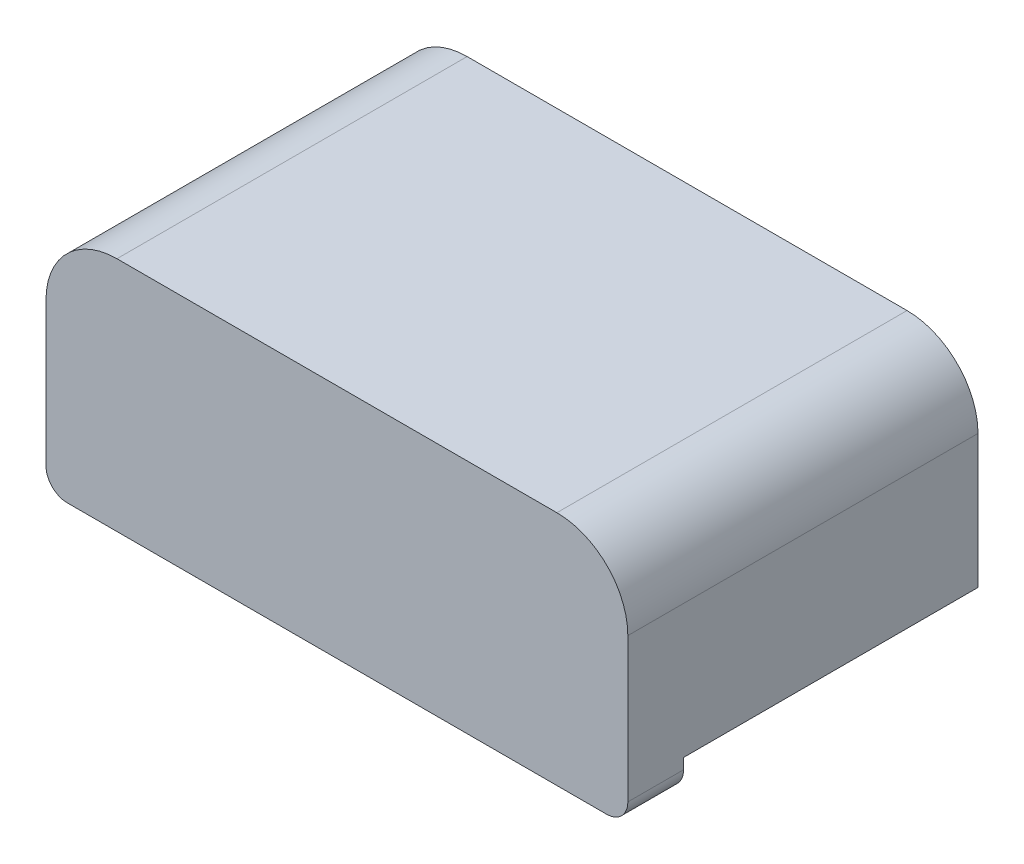
ISO-10303-21;
HEADER;
FILE_DESCRIPTION(('STEP AP214'),'2;1');
FILE_NAME('part.step','',(''),(''),'','','');
FILE_SCHEMA(('AUTOMOTIVE_DESIGN { 1 0 10303 214 1 1 1 1 }'));
ENDSEC;
DATA;
#1=APPLICATION_CONTEXT('core data for automotive mechanical design processes');
#2=APPLICATION_PROTOCOL_DEFINITION('international standard','automotive_design',2000,#1);
#3=PRODUCT_CONTEXT('',#1,'mechanical');
#4=PRODUCT('Part','Part','',(#3));
#5=PRODUCT_RELATED_PRODUCT_CATEGORY('part','',(#4));
#6=PRODUCT_DEFINITION_FORMATION('','',#4);
#7=PRODUCT_DEFINITION_CONTEXT('part definition',#1,'design');
#8=PRODUCT_DEFINITION('design','',#6,#7);
#9=PRODUCT_DEFINITION_SHAPE('','',#8);
#10=(LENGTH_UNIT() NAMED_UNIT(*) SI_UNIT(.MILLI.,.METRE.));
#11=(NAMED_UNIT(*) PLANE_ANGLE_UNIT() SI_UNIT($,.RADIAN.));
#12=(NAMED_UNIT(*) SI_UNIT($,.STERADIAN.) SOLID_ANGLE_UNIT());
#13=UNCERTAINTY_MEASURE_WITH_UNIT(LENGTH_MEASURE(1.E-05),#10,'distance_accuracy_value','');
#14=(GEOMETRIC_REPRESENTATION_CONTEXT(3) GLOBAL_UNCERTAINTY_ASSIGNED_CONTEXT((#13)) GLOBAL_UNIT_ASSIGNED_CONTEXT((#10,
#11,#12)) REPRESENTATION_CONTEXT('',''));
#15=CARTESIAN_POINT('',(0.,0.,0.));
#16=DIRECTION('',(0.,0.,1.));
#17=DIRECTION('',(1.,0.,0.));
#18=AXIS2_PLACEMENT_3D('',#15,#16,#17);
#19=CARTESIAN_POINT('',(0.,0.,0.));
#20=DIRECTION('',(0.,0.,-1.));
#21=DIRECTION('',(-1.,0.,0.));
#22=AXIS2_PLACEMENT_3D('',#19,#20,#21);
#23=PLANE('',#22);
#24=DIRECTION('',(-1.,0.,0.));
#25=VECTOR('',#24,1.);
#26=CARTESIAN_POINT('',(4.1,0.,0.));
#27=LINE('',#26,#25);
#28=CARTESIAN_POINT('',(-3.5,0.,0.));
#29=VERTEX_POINT('',#28);
#30=CARTESIAN_POINT('',(-4.1,0.,0.));
#31=VERTEX_POINT('',#30);
#32=EDGE_CURVE('E39',#29,#31,#27,.T.);
#33=ORIENTED_EDGE('',*,*,#32,.F.);
#34=DIRECTION('',(0.,1.,0.));
#35=VECTOR('',#34,1.);
#36=CARTESIAN_POINT('',(-3.5,-4.05555127546399,0.));
#37=LINE('',#36,#35);
#38=CARTESIAN_POINT('',(-3.5,-0.45,0.));
#39=VERTEX_POINT('',#38);
#40=EDGE_CURVE('E181',#39,#29,#37,.T.);
#41=ORIENTED_EDGE('',*,*,#40,.F.);
#42=DIRECTION('',(1.,0.,0.));
#43=VECTOR('',#42,1.);
#44=CARTESIAN_POINT('',(-4.1,-0.45,0.));
#45=LINE('',#44,#43);
#46=CARTESIAN_POINT('',(-3.8,-0.45,0.));
#47=VERTEX_POINT('',#46);
#48=EDGE_CURVE('E235',#47,#39,#45,.T.);
#49=ORIENTED_EDGE('',*,*,#48,.F.);
#50=CARTESIAN_POINT('',(-3.8,-0.15,0.));
#51=DIRECTION('',(0.,0.,-1.));
#52=DIRECTION('',(-1.,0.,0.));
#53=AXIS2_PLACEMENT_3D('',#50,#51,#52);
#54=CIRCLE('',#53,0.3);
#55=CARTESIAN_POINT('',(-4.1,-0.15,0.));
#56=VERTEX_POINT('',#55);
#57=EDGE_CURVE('E278',#47,#56,#54,.T.);
#58=ORIENTED_EDGE('',*,*,#57,.T.);
#59=DIRECTION('',(0.,-1.,0.));
#60=VECTOR('',#59,1.);
#61=CARTESIAN_POINT('',(-4.1,-0.45,0.));
#62=LINE('',#61,#60);
#63=EDGE_CURVE('E241',#31,#56,#62,.T.);
#64=ORIENTED_EDGE('',*,*,#63,.F.);
#65=EDGE_LOOP('',(#33,#41,#49,#58,#64));
#66=FACE_BOUND('',#65,.T.);
#67=ADVANCED_FACE('F35',(#66),#23,.T.);
#68=CARTESIAN_POINT('',(-1.5,-0.45,0.));
#69=VERTEX_POINT('',#68);
#70=CARTESIAN_POINT('',(1.5,-0.45,0.));
#71=VERTEX_POINT('',#70);
#72=EDGE_CURVE('E179',#69,#71,#45,.T.);
#73=ORIENTED_EDGE('',*,*,#72,.F.);
#74=DIRECTION('',(0.,1.,0.));
#75=VECTOR('',#74,1.);
#76=CARTESIAN_POINT('',(-1.5,-4.05555127546399,0.));
#77=LINE('',#76,#75);
#78=CARTESIAN_POINT('',(-1.5,0.,0.));
#79=VERTEX_POINT('',#78);
#80=EDGE_CURVE('E53',#69,#79,#77,.T.);
#81=ORIENTED_EDGE('',*,*,#80,.T.);
#82=CARTESIAN_POINT('',(1.5,0.,0.));
#83=VERTEX_POINT('',#82);
#84=EDGE_CURVE('E177',#83,#79,#27,.T.);
#85=ORIENTED_EDGE('',*,*,#84,.F.);
#86=DIRECTION('',(0.,1.,0.));
#87=VECTOR('',#86,1.);
#88=CARTESIAN_POINT('',(1.5,-4.05555127546399,0.));
#89=LINE('',#88,#87);
#90=EDGE_CURVE('E376',#71,#83,#89,.T.);
#91=ORIENTED_EDGE('',*,*,#90,.F.);
#92=EDGE_LOOP('',(#73,#81,#85,#91));
#93=FACE_BOUND('',#92,.T.);
#94=ADVANCED_FACE('F175',(#93),#23,.T.);
#95=CARTESIAN_POINT('',(4.1,0.,-17.7760528706251));
#96=DIRECTION('',(0.,1.,0.));
#97=DIRECTION('',(0.,0.,1.));
#98=AXIS2_PLACEMENT_3D('',#95,#96,#97);
#99=PLANE('',#98);
#100=DIRECTION('',(0.,0.,-1.));
#101=VECTOR('',#100,1.);
#102=CARTESIAN_POINT('',(-3.5,0.,-3.));
#103=LINE('',#102,#101);
#104=CARTESIAN_POINT('',(-3.5,0.,-3.));
#105=VERTEX_POINT('',#104);
#106=EDGE_CURVE('E170',#29,#105,#103,.T.);
#107=ORIENTED_EDGE('',*,*,#106,.F.);
#108=ORIENTED_EDGE('',*,*,#32,.T.);
#109=DIRECTION('',(0.,0.,1.));
#110=VECTOR('',#109,1.);
#111=CARTESIAN_POINT('',(-4.1,0.,-17.7760528706251));
#112=LINE('',#111,#110);
#113=CARTESIAN_POINT('',(-4.1,0.,-4.15));
#114=VERTEX_POINT('',#113);
#115=EDGE_CURVE('E188',#114,#31,#112,.T.);
#116=ORIENTED_EDGE('',*,*,#115,.F.);
#117=DIRECTION('',(-1.,0.,0.));
#118=VECTOR('',#117,1.);
#119=CARTESIAN_POINT('',(4.1,0.,-4.15));
#120=LINE('',#119,#118);
#121=CARTESIAN_POINT('',(4.1,0.,-4.15));
#122=VERTEX_POINT('',#121);
#123=EDGE_CURVE('E258',#122,#114,#120,.T.);
#124=ORIENTED_EDGE('',*,*,#123,.F.);
#125=DIRECTION('',(0.,0.,1.));
#126=VECTOR('',#125,1.);
#127=CARTESIAN_POINT('',(4.1,0.,-17.7760528706251));
#128=LINE('',#127,#126);
#129=CARTESIAN_POINT('',(4.1,0.,0.));
#130=VERTEX_POINT('',#129);
#131=EDGE_CURVE('E190',#122,#130,#128,.T.);
#132=ORIENTED_EDGE('',*,*,#131,.T.);
#133=CARTESIAN_POINT('',(3.5,0.,0.));
#134=VERTEX_POINT('',#133);
#135=EDGE_CURVE('E187',#130,#134,#27,.T.);
#136=ORIENTED_EDGE('',*,*,#135,.T.);
#137=DIRECTION('',(0.,0.,1.));
#138=VECTOR('',#137,1.);
#139=CARTESIAN_POINT('',(3.5,0.,-3.));
#140=LINE('',#139,#138);
#141=CARTESIAN_POINT('',(3.5,0.,-3.));
#142=VERTEX_POINT('',#141);
#143=EDGE_CURVE('E375',#142,#134,#140,.T.);
#144=ORIENTED_EDGE('',*,*,#143,.F.);
#145=DIRECTION('',(1.,0.,0.));
#146=VECTOR('',#145,1.);
#147=CARTESIAN_POINT('',(1.5,0.,-3.));
#148=LINE('',#147,#146);
#149=CARTESIAN_POINT('',(1.5,0.,-3.));
#150=VERTEX_POINT('',#149);
#151=EDGE_CURVE('E384',#150,#142,#148,.T.);
#152=ORIENTED_EDGE('',*,*,#151,.F.);
#153=DIRECTION('',(0.,0.,-1.));
#154=VECTOR('',#153,1.);
#155=CARTESIAN_POINT('',(1.5,0.,-3.));
#156=LINE('',#155,#154);
#157=EDGE_CURVE('E186',#83,#150,#156,.T.);
#158=ORIENTED_EDGE('',*,*,#157,.F.);
#159=ORIENTED_EDGE('',*,*,#84,.T.);
#160=DIRECTION('',(0.,0.,1.));
#161=VECTOR('',#160,1.);
#162=CARTESIAN_POINT('',(-1.5,0.,-3.));
#163=LINE('',#162,#161);
#164=CARTESIAN_POINT('',(-1.5,0.,-3.));
#165=VERTEX_POINT('',#164);
#166=EDGE_CURVE('E162',#165,#79,#163,.T.);
#167=ORIENTED_EDGE('',*,*,#166,.F.);
#168=DIRECTION('',(1.,0.,0.));
#169=VECTOR('',#168,1.);
#170=CARTESIAN_POINT('',(-3.5,0.,-3.));
#171=LINE('',#170,#169);
#172=EDGE_CURVE('E398',#105,#165,#171,.T.);
#173=ORIENTED_EDGE('',*,*,#172,.F.);
#174=EDGE_LOOP('',(#107,#108,#116,#124,#132,#136,#144,#152,#158,#159,#167,#173));
#175=FACE_BOUND('',#174,.T.);
#176=ADVANCED_FACE('F184',(#175),#99,.F.);
#177=CARTESIAN_POINT('',(3.5,-0.45,0.));
#178=VERTEX_POINT('',#177);
#179=CARTESIAN_POINT('',(3.8,-0.45,0.));
#180=VERTEX_POINT('',#179);
#181=EDGE_CURVE('E61',#178,#180,#45,.T.);
#182=ORIENTED_EDGE('',*,*,#181,.F.);
#183=DIRECTION('',(0.,1.,0.));
#184=VECTOR('',#183,1.);
#185=CARTESIAN_POINT('',(3.5,-4.05555127546399,0.));
#186=LINE('',#185,#184);
#187=EDGE_CURVE('E306',#178,#134,#186,.T.);
#188=ORIENTED_EDGE('',*,*,#187,.T.);
#189=ORIENTED_EDGE('',*,*,#135,.F.);
#190=DIRECTION('',(0.,1.,0.));
#191=VECTOR('',#190,1.);
#192=CARTESIAN_POINT('',(4.1,-0.45,0.));
#193=LINE('',#192,#191);
#194=CARTESIAN_POINT('',(4.1,-0.15,0.));
#195=VERTEX_POINT('',#194);
#196=EDGE_CURVE('E231',#195,#130,#193,.T.);
#197=ORIENTED_EDGE('',*,*,#196,.F.);
#198=CARTESIAN_POINT('',(3.8,-0.15,0.));
#199=DIRECTION('',(0.,0.,-1.));
#200=DIRECTION('',(-1.,0.,0.));
#201=AXIS2_PLACEMENT_3D('',#198,#199,#200);
#202=CIRCLE('',#201,0.3);
#203=EDGE_CURVE('E293',#195,#180,#202,.T.);
#204=ORIENTED_EDGE('',*,*,#203,.T.);
#205=EDGE_LOOP('',(#182,#188,#189,#197,#204));
#206=FACE_BOUND('',#205,.T.);
#207=ADVANCED_FACE('F303',(#206),#23,.T.);
#208=CARTESIAN_POINT('',(-4.1,-0.45,0.785));
#209=DIRECTION('',(1.,0.,0.));
#210=DIRECTION('',(0.,0.,-1.));
#211=AXIS2_PLACEMENT_3D('',#208,#209,#210);
#212=PLANE('',#211);
#213=ORIENTED_EDGE('',*,*,#63,.T.);
#214=DIRECTION('',(0.,0.,-1.));
#215=VECTOR('',#214,1.);
#216=CARTESIAN_POINT('',(-4.1,-0.15,0.785));
#217=LINE('',#216,#215);
#218=CARTESIAN_POINT('',(-4.1,-0.15,0.785));
#219=VERTEX_POINT('',#218);
#220=EDGE_CURVE('E12',#56,#219,#217,.F.);
#221=ORIENTED_EDGE('',*,*,#220,.T.);
#222=DIRECTION('',(0.,-1.,0.));
#223=VECTOR('',#222,1.);
#224=CARTESIAN_POINT('',(-4.1,-0.45,0.785));
#225=LINE('',#224,#223);
#226=CARTESIAN_POINT('',(-4.1,1.88,0.785));
#227=VERTEX_POINT('',#226);
#228=EDGE_CURVE('E234',#227,#219,#225,.T.);
#229=ORIENTED_EDGE('',*,*,#228,.F.);
#230=DIRECTION('',(0.,0.,-1.));
#231=VECTOR('',#230,1.);
#232=CARTESIAN_POINT('',(-4.1,1.88,0.785));
#233=LINE('',#232,#231);
#234=CARTESIAN_POINT('',(-4.1,1.88,-4.15));
#235=VERTEX_POINT('',#234);
#236=EDGE_CURVE('E227',#227,#235,#233,.T.);
#237=ORIENTED_EDGE('',*,*,#236,.T.);
#238=DIRECTION('',(0.,1.,0.));
#239=VECTOR('',#238,1.);
#240=CARTESIAN_POINT('',(-4.1,2.88,-4.15));
#241=LINE('',#240,#239);
#242=EDGE_CURVE('E197',#114,#235,#241,.T.);
#243=ORIENTED_EDGE('',*,*,#242,.F.);
#244=ORIENTED_EDGE('',*,*,#115,.T.);
#245=EDGE_LOOP('',(#213,#221,#229,#237,#243,#244));
#246=FACE_BOUND('',#245,.T.);
#247=ADVANCED_FACE('F268',(#246),#212,.F.);
#248=CARTESIAN_POINT('',(-4.1,-0.45,0.785));
#249=DIRECTION('',(0.,1.,0.));
#250=DIRECTION('',(-1.,0.,0.));
#251=AXIS2_PLACEMENT_3D('',#248,#249,#250);
#252=PLANE('',#251);
#253=ORIENTED_EDGE('',*,*,#48,.T.);
#254=DIRECTION('',(0.,0.,1.));
#255=VECTOR('',#254,1.);
#256=CARTESIAN_POINT('',(-3.5,-0.45,-3.));
#257=LINE('',#256,#255);
#258=CARTESIAN_POINT('',(-3.5,-0.45,-3.));
#259=VERTEX_POINT('',#258);
#260=EDGE_CURVE('E366',#259,#39,#257,.T.);
#261=ORIENTED_EDGE('',*,*,#260,.F.);
#262=DIRECTION('',(-1.,0.,0.));
#263=VECTOR('',#262,1.);
#264=CARTESIAN_POINT('',(-3.5,-0.45,-3.));
#265=LINE('',#264,#263);
#266=CARTESIAN_POINT('',(-1.5,-0.45,-3.));
#267=VERTEX_POINT('',#266);
#268=EDGE_CURVE('E180',#267,#259,#265,.T.);
#269=ORIENTED_EDGE('',*,*,#268,.F.);
#270=DIRECTION('',(0.,0.,-1.));
#271=VECTOR('',#270,1.);
#272=CARTESIAN_POINT('',(-1.5,-0.45,-3.));
#273=LINE('',#272,#271);
#274=EDGE_CURVE('E388',#69,#267,#273,.T.);
#275=ORIENTED_EDGE('',*,*,#274,.F.);
#276=ORIENTED_EDGE('',*,*,#72,.T.);
#277=DIRECTION('',(0.,0.,1.));
#278=VECTOR('',#277,1.);
#279=CARTESIAN_POINT('',(1.5,-0.45,-3.));
#280=LINE('',#279,#278);
#281=CARTESIAN_POINT('',(1.5,-0.45,-3.));
#282=VERTEX_POINT('',#281);
#283=EDGE_CURVE('E373',#282,#71,#280,.T.);
#284=ORIENTED_EDGE('',*,*,#283,.F.);
#285=DIRECTION('',(-1.,0.,0.));
#286=VECTOR('',#285,1.);
#287=CARTESIAN_POINT('',(1.5,-0.45,-3.));
#288=LINE('',#287,#286);
#289=CARTESIAN_POINT('',(3.5,-0.45,-3.));
#290=VERTEX_POINT('',#289);
#291=EDGE_CURVE('E195',#290,#282,#288,.T.);
#292=ORIENTED_EDGE('',*,*,#291,.F.);
#293=DIRECTION('',(0.,0.,-1.));
#294=VECTOR('',#293,1.);
#295=CARTESIAN_POINT('',(3.5,-0.45,-3.));
#296=LINE('',#295,#294);
#297=EDGE_CURVE('E207',#178,#290,#296,.T.);
#298=ORIENTED_EDGE('',*,*,#297,.F.);
#299=ORIENTED_EDGE('',*,*,#181,.T.);
#300=DIRECTION('',(0.,0.,-1.));
#301=VECTOR('',#300,1.);
#302=CARTESIAN_POINT('',(3.8,-0.45,0.785));
#303=LINE('',#302,#301);
#304=CARTESIAN_POINT('',(3.8,-0.45,0.785));
#305=VERTEX_POINT('',#304);
#306=EDGE_CURVE('E288',#180,#305,#303,.F.);
#307=ORIENTED_EDGE('',*,*,#306,.T.);
#308=DIRECTION('',(1.,0.,0.));
#309=VECTOR('',#308,1.);
#310=CARTESIAN_POINT('',(-4.1,-0.45,0.785));
#311=LINE('',#310,#309);
#312=CARTESIAN_POINT('',(-3.8,-0.45,0.785));
#313=VERTEX_POINT('',#312);
#314=EDGE_CURVE('E249',#313,#305,#311,.T.);
#315=ORIENTED_EDGE('',*,*,#314,.F.);
#316=DIRECTION('',(0.,0.,-1.));
#317=VECTOR('',#316,1.);
#318=CARTESIAN_POINT('',(-3.8,-0.45,0.785));
#319=LINE('',#318,#317);
#320=EDGE_CURVE('E285',#313,#47,#319,.T.);
#321=ORIENTED_EDGE('',*,*,#320,.T.);
#322=EDGE_LOOP('',(#253,#261,#269,#275,#276,#284,#292,#298,#299,#307,#315,#321));
#323=FACE_BOUND('',#322,.T.);
#324=ADVANCED_FACE('F342',(#323),#252,.F.);
#325=CARTESIAN_POINT('',(4.1,-0.45,0.785));
#326=DIRECTION('',(-1.,0.,0.));
#327=DIRECTION('',(0.,0.,1.));
#328=AXIS2_PLACEMENT_3D('',#325,#326,#327);
#329=PLANE('',#328);
#330=DIRECTION('',(0.,1.,0.));
#331=VECTOR('',#330,1.);
#332=CARTESIAN_POINT('',(4.1,-0.45,0.785));
#333=LINE('',#332,#331);
#334=CARTESIAN_POINT('',(4.1,-0.15,0.785));
#335=VERTEX_POINT('',#334);
#336=CARTESIAN_POINT('',(4.1,1.88,0.785));
#337=VERTEX_POINT('',#336);
#338=EDGE_CURVE('E247',#335,#337,#333,.T.);
#339=ORIENTED_EDGE('',*,*,#338,.F.);
#340=DIRECTION('',(0.,0.,-1.));
#341=VECTOR('',#340,1.);
#342=CARTESIAN_POINT('',(4.1,-0.15,0.785));
#343=LINE('',#342,#341);
#344=EDGE_CURVE('E230',#335,#195,#343,.T.);
#345=ORIENTED_EDGE('',*,*,#344,.T.);
#346=ORIENTED_EDGE('',*,*,#196,.T.);
#347=ORIENTED_EDGE('',*,*,#131,.F.);
#348=DIRECTION('',(0.,-1.,0.));
#349=VECTOR('',#348,1.);
#350=CARTESIAN_POINT('',(4.1,2.88,-4.15));
#351=LINE('',#350,#349);
#352=CARTESIAN_POINT('',(4.1,1.88,-4.15));
#353=VERTEX_POINT('',#352);
#354=EDGE_CURVE('E257',#353,#122,#351,.T.);
#355=ORIENTED_EDGE('',*,*,#354,.F.);
#356=DIRECTION('',(0.,0.,-1.));
#357=VECTOR('',#356,1.);
#358=CARTESIAN_POINT('',(4.1,1.88,0.785));
#359=LINE('',#358,#357);
#360=EDGE_CURVE('E220',#353,#337,#359,.F.);
#361=ORIENTED_EDGE('',*,*,#360,.T.);
#362=EDGE_LOOP('',(#339,#345,#346,#347,#355,#361));
#363=FACE_BOUND('',#362,.T.);
#364=ADVANCED_FACE('F299',(#363),#329,.F.);
#365=CARTESIAN_POINT('',(-4.1,2.88,0.785));
#366=DIRECTION('',(0.,-1.,0.));
#367=DIRECTION('',(0.,0.,-1.));
#368=AXIS2_PLACEMENT_3D('',#365,#366,#367);
#369=PLANE('',#368);
#370=DIRECTION('',(-1.,0.,0.));
#371=VECTOR('',#370,1.);
#372=CARTESIAN_POINT('',(-4.1,2.88,0.785));
#373=LINE('',#372,#371);
#374=CARTESIAN_POINT('',(3.1,2.88,0.785));
#375=VERTEX_POINT('',#374);
#376=CARTESIAN_POINT('',(-3.1,2.88,0.785));
#377=VERTEX_POINT('',#376);
#378=EDGE_CURVE('E213',#375,#377,#373,.T.);
#379=ORIENTED_EDGE('',*,*,#378,.F.);
#380=DIRECTION('',(0.,0.,-1.));
#381=VECTOR('',#380,1.);
#382=CARTESIAN_POINT('',(3.1,2.88,0.785));
#383=LINE('',#382,#381);
#384=CARTESIAN_POINT('',(3.1,2.88,-4.15));
#385=VERTEX_POINT('',#384);
#386=EDGE_CURVE('E212',#375,#385,#383,.T.);
#387=ORIENTED_EDGE('',*,*,#386,.T.);
#388=DIRECTION('',(1.,0.,0.));
#389=VECTOR('',#388,1.);
#390=CARTESIAN_POINT('',(4.1,2.88,-4.15));
#391=LINE('',#390,#389);
#392=CARTESIAN_POINT('',(-3.1,2.88,-4.15));
#393=VERTEX_POINT('',#392);
#394=EDGE_CURVE('E254',#393,#385,#391,.T.);
#395=ORIENTED_EDGE('',*,*,#394,.F.);
#396=DIRECTION('',(0.,0.,-1.));
#397=VECTOR('',#396,1.);
#398=CARTESIAN_POINT('',(-3.1,2.88,0.785));
#399=LINE('',#398,#397);
#400=EDGE_CURVE('E210',#393,#377,#399,.F.);
#401=ORIENTED_EDGE('',*,*,#400,.T.);
#402=EDGE_LOOP('',(#379,#387,#395,#401));
#403=FACE_BOUND('',#402,.T.);
#404=ADVANCED_FACE('F318',(#403),#369,.F.);
#405=CARTESIAN_POINT('',(0.,0.,0.785));
#406=DIRECTION('',(0.,0.,-1.));
#407=DIRECTION('',(-1.,0.,0.));
#408=AXIS2_PLACEMENT_3D('',#405,#406,#407);
#409=PLANE('',#408);
#410=ORIENTED_EDGE('',*,*,#314,.T.);
#411=CARTESIAN_POINT('',(3.8,-0.15,0.785));
#412=DIRECTION('',(0.,0.,-1.));
#413=DIRECTION('',(-1.,0.,0.));
#414=AXIS2_PLACEMENT_3D('',#411,#412,#413);
#415=CIRCLE('',#414,0.3);
#416=EDGE_CURVE('E45',#305,#335,#415,.F.);
#417=ORIENTED_EDGE('',*,*,#416,.T.);
#418=ORIENTED_EDGE('',*,*,#338,.T.);
#419=CARTESIAN_POINT('',(3.1,1.88,0.785));
#420=DIRECTION('',(0.,0.,-1.));
#421=DIRECTION('',(-1.,0.,0.));
#422=AXIS2_PLACEMENT_3D('',#419,#420,#421);
#423=CIRCLE('',#422,1.);
#424=EDGE_CURVE('E225',#337,#375,#423,.F.);
#425=ORIENTED_EDGE('',*,*,#424,.T.);
#426=ORIENTED_EDGE('',*,*,#378,.T.);
#427=CARTESIAN_POINT('',(-3.1,1.88,0.785));
#428=DIRECTION('',(0.,0.,-1.));
#429=DIRECTION('',(-1.,0.,0.));
#430=AXIS2_PLACEMENT_3D('',#427,#428,#429);
#431=CIRCLE('',#430,1.);
#432=EDGE_CURVE('E223',#377,#227,#431,.F.);
#433=ORIENTED_EDGE('',*,*,#432,.T.);
#434=ORIENTED_EDGE('',*,*,#228,.T.);
#435=CARTESIAN_POINT('',(-3.8,-0.15,0.785));
#436=DIRECTION('',(0.,0.,-1.));
#437=DIRECTION('',(-1.,0.,0.));
#438=AXIS2_PLACEMENT_3D('',#435,#436,#437);
#439=CIRCLE('',#438,0.3);
#440=EDGE_CURVE('E284',#219,#313,#439,.F.);
#441=ORIENTED_EDGE('',*,*,#440,.T.);
#442=EDGE_LOOP('',(#410,#417,#418,#425,#426,#433,#434,#441));
#443=FACE_BOUND('',#442,.T.);
#444=ADVANCED_FACE('F315',(#443),#409,.F.);
#445=CARTESIAN_POINT('',(0.,0.,-4.15));
#446=DIRECTION('',(0.,0.,-1.));
#447=DIRECTION('',(-1.,0.,0.));
#448=AXIS2_PLACEMENT_3D('',#445,#446,#447);
#449=PLANE('',#448);
#450=ORIENTED_EDGE('',*,*,#394,.T.);
#451=CARTESIAN_POINT('',(3.1,1.88,-4.15));
#452=DIRECTION('',(0.,0.,-1.));
#453=DIRECTION('',(-1.,0.,0.));
#454=AXIS2_PLACEMENT_3D('',#451,#452,#453);
#455=CIRCLE('',#454,1.);
#456=EDGE_CURVE('E218',#385,#353,#455,.T.);
#457=ORIENTED_EDGE('',*,*,#456,.T.);
#458=ORIENTED_EDGE('',*,*,#354,.T.);
#459=ORIENTED_EDGE('',*,*,#123,.T.);
#460=ORIENTED_EDGE('',*,*,#242,.T.);
#461=CARTESIAN_POINT('',(-3.1,1.88,-4.15));
#462=DIRECTION('',(0.,0.,-1.));
#463=DIRECTION('',(-1.,0.,0.));
#464=AXIS2_PLACEMENT_3D('',#461,#462,#463);
#465=CIRCLE('',#464,1.);
#466=EDGE_CURVE('E216',#235,#393,#465,.T.);
#467=ORIENTED_EDGE('',*,*,#466,.T.);
#468=EDGE_LOOP('',(#450,#457,#458,#459,#460,#467));
#469=FACE_BOUND('',#468,.T.);
#470=ADVANCED_FACE('F263',(#469),#449,.T.);
#471=CARTESIAN_POINT('',(3.1,1.88,0.785));
#472=DIRECTION('',(0.,0.,-1.));
#473=DIRECTION('',(-1.,0.,0.));
#474=AXIS2_PLACEMENT_3D('',#471,#472,#473);
#475=CYLINDRICAL_SURFACE('',#474,1.);
#476=ORIENTED_EDGE('',*,*,#424,.F.);
#477=ORIENTED_EDGE('',*,*,#360,.F.);
#478=ORIENTED_EDGE('',*,*,#456,.F.);
#479=ORIENTED_EDGE('',*,*,#386,.F.);
#480=EDGE_LOOP('',(#476,#477,#478,#479));
#481=FACE_BOUND('',#480,.T.);
#482=ADVANCED_FACE('F312',(#481),#475,.T.);
#483=CARTESIAN_POINT('',(-3.1,1.88,0.785));
#484=DIRECTION('',(0.,0.,-1.));
#485=DIRECTION('',(-1.,0.,0.));
#486=AXIS2_PLACEMENT_3D('',#483,#484,#485);
#487=CYLINDRICAL_SURFACE('',#486,1.);
#488=ORIENTED_EDGE('',*,*,#432,.F.);
#489=ORIENTED_EDGE('',*,*,#400,.F.);
#490=ORIENTED_EDGE('',*,*,#466,.F.);
#491=ORIENTED_EDGE('',*,*,#236,.F.);
#492=EDGE_LOOP('',(#488,#489,#490,#491));
#493=FACE_BOUND('',#492,.T.);
#494=ADVANCED_FACE('F321',(#493),#487,.T.);
#495=CARTESIAN_POINT('',(3.8,-0.15,0.785));
#496=DIRECTION('',(0.,0.,-1.));
#497=DIRECTION('',(-1.,0.,0.));
#498=AXIS2_PLACEMENT_3D('',#495,#496,#497);
#499=CYLINDRICAL_SURFACE('',#498,0.3);
#500=ORIENTED_EDGE('',*,*,#416,.F.);
#501=ORIENTED_EDGE('',*,*,#306,.F.);
#502=ORIENTED_EDGE('',*,*,#203,.F.);
#503=ORIENTED_EDGE('',*,*,#344,.F.);
#504=EDGE_LOOP('',(#500,#501,#502,#503));
#505=FACE_BOUND('',#504,.T.);
#506=ADVANCED_FACE('F323',(#505),#499,.T.);
#507=CARTESIAN_POINT('',(-3.8,-0.15,0.785));
#508=DIRECTION('',(0.,0.,-1.));
#509=DIRECTION('',(-1.,0.,0.));
#510=AXIS2_PLACEMENT_3D('',#507,#508,#509);
#511=CYLINDRICAL_SURFACE('',#510,0.3);
#512=ORIENTED_EDGE('',*,*,#440,.F.);
#513=ORIENTED_EDGE('',*,*,#220,.F.);
#514=ORIENTED_EDGE('',*,*,#57,.F.);
#515=ORIENTED_EDGE('',*,*,#320,.F.);
#516=EDGE_LOOP('',(#512,#513,#514,#515));
#517=FACE_BOUND('',#516,.T.);
#518=ADVANCED_FACE('F37',(#517),#511,.T.);
#519=CARTESIAN_POINT('',(1.5,-4.05555127546399,-3.));
#520=DIRECTION('',(0.,0.,1.));
#521=DIRECTION('',(1.,0.,0.));
#522=AXIS2_PLACEMENT_3D('',#519,#520,#521);
#523=PLANE('',#522);
#524=DIRECTION('',(0.,1.,0.));
#525=VECTOR('',#524,1.);
#526=CARTESIAN_POINT('',(3.5,-4.05555127546399,-3.));
#527=LINE('',#526,#525);
#528=EDGE_CURVE('E382',#290,#142,#527,.T.);
#529=ORIENTED_EDGE('',*,*,#528,.F.);
#530=ORIENTED_EDGE('',*,*,#291,.T.);
#531=DIRECTION('',(0.,1.,0.));
#532=VECTOR('',#531,1.);
#533=CARTESIAN_POINT('',(1.5,-4.05555127546399,-3.));
#534=LINE('',#533,#532);
#535=EDGE_CURVE('E377',#282,#150,#534,.T.);
#536=ORIENTED_EDGE('',*,*,#535,.T.);
#537=ORIENTED_EDGE('',*,*,#151,.T.);
#538=EDGE_LOOP('',(#529,#530,#536,#537));
#539=FACE_BOUND('',#538,.T.);
#540=ADVANCED_FACE('F410',(#539),#523,.F.);
#541=CARTESIAN_POINT('',(1.5,-4.05555127546399,-3.));
#542=DIRECTION('',(1.,0.,0.));
#543=DIRECTION('',(0.,0.,-1.));
#544=AXIS2_PLACEMENT_3D('',#541,#542,#543);
#545=PLANE('',#544);
#546=ORIENTED_EDGE('',*,*,#535,.F.);
#547=ORIENTED_EDGE('',*,*,#283,.T.);
#548=ORIENTED_EDGE('',*,*,#90,.T.);
#549=ORIENTED_EDGE('',*,*,#157,.T.);
#550=EDGE_LOOP('',(#546,#547,#548,#549));
#551=FACE_BOUND('',#550,.T.);
#552=ADVANCED_FACE('F408',(#551),#545,.F.);
#553=CARTESIAN_POINT('',(3.5,-4.05555127546399,-3.));
#554=DIRECTION('',(-1.,0.,0.));
#555=DIRECTION('',(0.,0.,1.));
#556=AXIS2_PLACEMENT_3D('',#553,#554,#555);
#557=PLANE('',#556);
#558=ORIENTED_EDGE('',*,*,#187,.F.);
#559=ORIENTED_EDGE('',*,*,#297,.T.);
#560=ORIENTED_EDGE('',*,*,#528,.T.);
#561=ORIENTED_EDGE('',*,*,#143,.T.);
#562=EDGE_LOOP('',(#558,#559,#560,#561));
#563=FACE_BOUND('',#562,.T.);
#564=ADVANCED_FACE('F349',(#563),#557,.F.);
#565=CARTESIAN_POINT('',(-3.5,-4.05555127546399,-3.));
#566=DIRECTION('',(0.,0.,1.));
#567=DIRECTION('',(1.,0.,0.));
#568=AXIS2_PLACEMENT_3D('',#565,#566,#567);
#569=PLANE('',#568);
#570=DIRECTION('',(0.,1.,0.));
#571=VECTOR('',#570,1.);
#572=CARTESIAN_POINT('',(-1.5,-4.05555127546399,-3.));
#573=LINE('',#572,#571);
#574=EDGE_CURVE('E165',#267,#165,#573,.T.);
#575=ORIENTED_EDGE('',*,*,#574,.F.);
#576=ORIENTED_EDGE('',*,*,#268,.T.);
#577=DIRECTION('',(0.,1.,0.));
#578=VECTOR('',#577,1.);
#579=CARTESIAN_POINT('',(-3.5,-4.05555127546399,-3.));
#580=LINE('',#579,#578);
#581=EDGE_CURVE('E395',#259,#105,#580,.T.);
#582=ORIENTED_EDGE('',*,*,#581,.T.);
#583=ORIENTED_EDGE('',*,*,#172,.T.);
#584=EDGE_LOOP('',(#575,#576,#582,#583));
#585=FACE_BOUND('',#584,.T.);
#586=ADVANCED_FACE('F405',(#585),#569,.F.);
#587=CARTESIAN_POINT('',(-3.5,-4.05555127546399,-3.));
#588=DIRECTION('',(1.,0.,0.));
#589=DIRECTION('',(0.,0.,-1.));
#590=AXIS2_PLACEMENT_3D('',#587,#588,#589);
#591=PLANE('',#590);
#592=ORIENTED_EDGE('',*,*,#581,.F.);
#593=ORIENTED_EDGE('',*,*,#260,.T.);
#594=ORIENTED_EDGE('',*,*,#40,.T.);
#595=ORIENTED_EDGE('',*,*,#106,.T.);
#596=EDGE_LOOP('',(#592,#593,#594,#595));
#597=FACE_BOUND('',#596,.T.);
#598=ADVANCED_FACE('F403',(#597),#591,.F.);
#599=CARTESIAN_POINT('',(-1.5,-4.05555127546399,-3.));
#600=DIRECTION('',(-1.,0.,0.));
#601=DIRECTION('',(0.,0.,1.));
#602=AXIS2_PLACEMENT_3D('',#599,#600,#601);
#603=PLANE('',#602);
#604=ORIENTED_EDGE('',*,*,#80,.F.);
#605=ORIENTED_EDGE('',*,*,#274,.T.);
#606=ORIENTED_EDGE('',*,*,#574,.T.);
#607=ORIENTED_EDGE('',*,*,#166,.T.);
#608=EDGE_LOOP('',(#604,#605,#606,#607));
#609=FACE_BOUND('',#608,.T.);
#610=ADVANCED_FACE('F163',(#609),#603,.F.);
#611=CLOSED_SHELL('',(#67,#94,#176,#207,#247,#324,#364,#404,#444,#470,#482,#494,#506,#518,#540,
#552,#564,#586,#598,#610));
#612=MANIFOLD_SOLID_BREP('B2',#611);
#613=ADVANCED_BREP_SHAPE_REPRESENTATION('',(#18,#612),#14);
#614=SHAPE_DEFINITION_REPRESENTATION(#9,#613);
ENDSEC;
END-ISO-10303-21;
